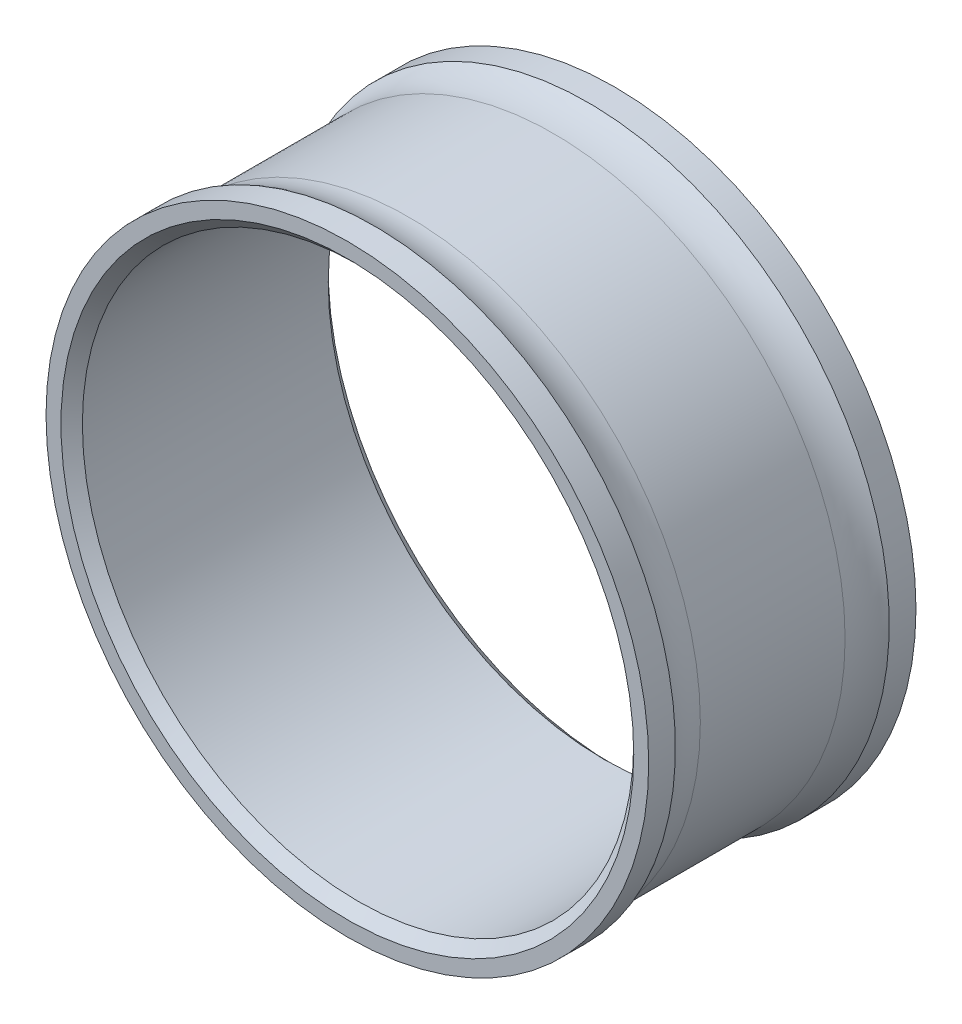
ISO-10303-21;
HEADER;
FILE_DESCRIPTION(('STEP AP214'),'2;1');
FILE_NAME('part.step','',(''),(''),'','','');
FILE_SCHEMA(('AUTOMOTIVE_DESIGN { 1 0 10303 214 1 1 1 1 }'));
ENDSEC;
DATA;
#1=APPLICATION_CONTEXT('core data for automotive mechanical design processes');
#2=APPLICATION_PROTOCOL_DEFINITION('international standard','automotive_design',2000,#1);
#3=PRODUCT_CONTEXT('',#1,'mechanical');
#4=PRODUCT('Part','Part','',(#3));
#5=PRODUCT_RELATED_PRODUCT_CATEGORY('part','',(#4));
#6=PRODUCT_DEFINITION_FORMATION('','',#4);
#7=PRODUCT_DEFINITION_CONTEXT('part definition',#1,'design');
#8=PRODUCT_DEFINITION('design','',#6,#7);
#9=PRODUCT_DEFINITION_SHAPE('','',#8);
#10=(LENGTH_UNIT() NAMED_UNIT(*) SI_UNIT(.MILLI.,.METRE.));
#11=(NAMED_UNIT(*) PLANE_ANGLE_UNIT() SI_UNIT($,.RADIAN.));
#12=(NAMED_UNIT(*) SI_UNIT($,.STERADIAN.) SOLID_ANGLE_UNIT());
#13=UNCERTAINTY_MEASURE_WITH_UNIT(LENGTH_MEASURE(1.E-05),#10,'distance_accuracy_value','');
#14=(GEOMETRIC_REPRESENTATION_CONTEXT(3) GLOBAL_UNCERTAINTY_ASSIGNED_CONTEXT((#13)) GLOBAL_UNIT_ASSIGNED_CONTEXT((#10,
#11,#12)) REPRESENTATION_CONTEXT('',''));
#15=CARTESIAN_POINT('',(0.,0.,0.));
#16=DIRECTION('',(0.,0.,1.));
#17=DIRECTION('',(1.,0.,0.));
#18=AXIS2_PLACEMENT_3D('',#15,#16,#17);
#19=CARTESIAN_POINT('',(0.,0.,-15.875));
#20=DIRECTION('',(0.,0.,1.));
#21=DIRECTION('',(-1.,0.,0.));
#22=AXIS2_PLACEMENT_3D('',#19,#20,#21);
#23=CYLINDRICAL_SURFACE('',#22,35.8013);
#24=CARTESIAN_POINT('',(0.,0.,15.875));
#25=DIRECTION('',(0.,0.,1.));
#26=DIRECTION('',(1.,0.,0.));
#27=AXIS2_PLACEMENT_3D('',#24,#25,#26);
#28=CIRCLE('',#27,35.8013);
#29=CARTESIAN_POINT('',(35.8013,0.,15.875));
#30=VERTEX_POINT('',#29);
#31=EDGE_CURVE('E53',#30,#30,#28,.T.);
#32=ORIENTED_EDGE('',*,*,#31,.F.);
#33=EDGE_LOOP('',(#32));
#34=FACE_BOUND('',#33,.T.);
#35=CARTESIAN_POINT('',(0.,0.,12.7));
#36=DIRECTION('',(0.,0.,-1.));
#37=DIRECTION('',(-1.,0.,0.));
#38=AXIS2_PLACEMENT_3D('',#35,#36,#37);
#39=CIRCLE('',#38,35.8013);
#40=CARTESIAN_POINT('',(-35.8013,0.,12.7));
#41=VERTEX_POINT('',#40);
#42=EDGE_CURVE('E67',#41,#41,#39,.T.);
#43=ORIENTED_EDGE('',*,*,#42,.F.);
#44=EDGE_LOOP('',(#43));
#45=FACE_BOUND('',#44,.T.);
#46=ADVANCED_FACE('F32',(#34,#45),#23,.T.);
#47=CARTESIAN_POINT('',(0.,0.,-15.875));
#48=DIRECTION('',(0.,0.,1.));
#49=DIRECTION('',(1.,0.,0.));
#50=AXIS2_PLACEMENT_3D('',#47,#48,#49);
#51=CIRCLE('',#50,35.8013);
#52=CARTESIAN_POINT('',(35.8013,0.,-15.875));
#53=VERTEX_POINT('',#52);
#54=EDGE_CURVE('E52',#53,#53,#51,.T.);
#55=ORIENTED_EDGE('',*,*,#54,.T.);
#56=EDGE_LOOP('',(#55));
#57=FACE_BOUND('',#56,.T.);
#58=CARTESIAN_POINT('',(0.,0.,-12.7));
#59=DIRECTION('',(0.,0.,-1.));
#60=DIRECTION('',(-1.,0.,0.));
#61=AXIS2_PLACEMENT_3D('',#58,#59,#60);
#62=CIRCLE('',#61,35.8013);
#63=CARTESIAN_POINT('',(-35.8013,0.,-12.7));
#64=VERTEX_POINT('',#63);
#65=EDGE_CURVE('E64',#64,#64,#62,.T.);
#66=ORIENTED_EDGE('',*,*,#65,.T.);
#67=EDGE_LOOP('',(#66));
#68=FACE_BOUND('',#67,.T.);
#69=ADVANCED_FACE('F74',(#57,#68),#23,.T.);
#70=CARTESIAN_POINT('',(0.,0.,-15.875));
#71=DIRECTION('',(0.,0.,-1.));
#72=DIRECTION('',(1.,0.,0.));
#73=AXIS2_PLACEMENT_3D('',#70,#71,#72);
#74=PLANE('',#73);
#75=CARTESIAN_POINT('',(0.,0.,-15.875));
#76=DIRECTION('',(0.,0.,1.));
#77=DIRECTION('',(1.,0.,0.));
#78=AXIS2_PLACEMENT_3D('',#75,#76,#77);
#79=CIRCLE('',#78,34.024);
#80=CARTESIAN_POINT('',(34.024,0.,-15.875));
#81=VERTEX_POINT('',#80);
#82=EDGE_CURVE('E10',#81,#81,#79,.F.);
#83=ORIENTED_EDGE('',*,*,#82,.F.);
#84=EDGE_LOOP('',(#83));
#85=FACE_BOUND('',#84,.T.);
#86=ORIENTED_EDGE('',*,*,#54,.F.);
#87=EDGE_LOOP('',(#86));
#88=FACE_BOUND('',#87,.T.);
#89=ADVANCED_FACE('F80',(#85,#88),#74,.T.);
#90=CARTESIAN_POINT('',(0.,0.,15.875));
#91=DIRECTION('',(0.,0.,-1.));
#92=DIRECTION('',(1.,0.,0.));
#93=AXIS2_PLACEMENT_3D('',#90,#91,#92);
#94=PLANE('',#93);
#95=CARTESIAN_POINT('',(0.,0.,15.875));
#96=DIRECTION('',(0.,0.,1.));
#97=DIRECTION('',(1.,0.,0.));
#98=AXIS2_PLACEMENT_3D('',#95,#96,#97);
#99=CIRCLE('',#98,34.024);
#100=CARTESIAN_POINT('',(34.024,0.,15.875));
#101=VERTEX_POINT('',#100);
#102=EDGE_CURVE('E47',#101,#101,#99,.T.);
#103=ORIENTED_EDGE('',*,*,#102,.F.);
#104=EDGE_LOOP('',(#103));
#105=FACE_BOUND('',#104,.T.);
#106=ORIENTED_EDGE('',*,*,#31,.T.);
#107=EDGE_LOOP('',(#106));
#108=FACE_BOUND('',#107,.T.);
#109=ADVANCED_FACE('F84',(#105,#108),#94,.F.);
#110=CARTESIAN_POINT('',(0.,0.,-15.875));
#111=DIRECTION('',(0.,0.,1.));
#112=DIRECTION('',(-1.,0.,0.));
#113=AXIS2_PLACEMENT_3D('',#110,#111,#112);
#114=CYLINDRICAL_SURFACE('',#113,32.754);
#115=CARTESIAN_POINT('',(0.,0.,14.605));
#116=DIRECTION('',(0.,0.,1.));
#117=DIRECTION('',(1.,0.,0.));
#118=AXIS2_PLACEMENT_3D('',#115,#116,#117);
#119=CIRCLE('',#118,32.754);
#120=CARTESIAN_POINT('',(32.754,0.,14.605));
#121=VERTEX_POINT('',#120);
#122=EDGE_CURVE('E39',#121,#121,#119,.F.);
#123=ORIENTED_EDGE('',*,*,#122,.F.);
#124=EDGE_LOOP('',(#123));
#125=FACE_BOUND('',#124,.T.);
#126=CARTESIAN_POINT('',(0.,0.,-14.605));
#127=DIRECTION('',(0.,0.,1.));
#128=DIRECTION('',(1.,0.,0.));
#129=AXIS2_PLACEMENT_3D('',#126,#127,#128);
#130=CIRCLE('',#129,32.754);
#131=CARTESIAN_POINT('',(32.754,0.,-14.605));
#132=VERTEX_POINT('',#131);
#133=EDGE_CURVE('E43',#132,#132,#130,.T.);
#134=ORIENTED_EDGE('',*,*,#133,.F.);
#135=EDGE_LOOP('',(#134));
#136=FACE_BOUND('',#135,.T.);
#137=ADVANCED_FACE('F88',(#125,#136),#114,.F.);
#138=CARTESIAN_POINT('',(0.,0.,15.875));
#139=DIRECTION('',(0.,0.,1.));
#140=DIRECTION('',(-1.,0.,0.));
#141=AXIS2_PLACEMENT_3D('',#138,#139,#140);
#142=CONICAL_SURFACE('',#141,34.024,0.785398163397446);
#143=ORIENTED_EDGE('',*,*,#122,.T.);
#144=EDGE_LOOP('',(#143));
#145=FACE_BOUND('',#144,.T.);
#146=ORIENTED_EDGE('',*,*,#102,.T.);
#147=EDGE_LOOP('',(#146));
#148=FACE_BOUND('',#147,.T.);
#149=ADVANCED_FACE('F86',(#145,#148),#142,.F.);
#150=CARTESIAN_POINT('',(0.,0.,-14.605));
#151=DIRECTION('',(0.,0.,-1.));
#152=DIRECTION('',(1.,0.,0.));
#153=AXIS2_PLACEMENT_3D('',#150,#151,#152);
#154=CONICAL_SURFACE('',#153,32.754,0.785398163397451);
#155=ORIENTED_EDGE('',*,*,#82,.T.);
#156=EDGE_LOOP('',(#155));
#157=FACE_BOUND('',#156,.T.);
#158=ORIENTED_EDGE('',*,*,#133,.T.);
#159=EDGE_LOOP('',(#158));
#160=FACE_BOUND('',#159,.T.);
#161=ADVANCED_FACE('F34',(#157,#160),#154,.F.);
#162=CARTESIAN_POINT('',(0.,0.,8.59766368882315));
#163=DIRECTION('',(0.,0.,1.));
#164=DIRECTION('',(-1.,0.,0.));
#165=AXIS2_PLACEMENT_3D('',#162,#163,#164);
#166=TOROIDAL_SURFACE('',#165,42.5965,7.9375);
#167=CARTESIAN_POINT('',(0.,0.,8.59766368882315));
#168=DIRECTION('',(0.,0.,-1.));
#169=DIRECTION('',(-1.,0.,0.));
#170=AXIS2_PLACEMENT_3D('',#167,#168,#169);
#171=CIRCLE('',#170,34.659);
#172=CARTESIAN_POINT('',(-34.659,0.,8.59766368882315));
#173=VERTEX_POINT('',#172);
#174=EDGE_CURVE('E56',#173,#173,#171,.T.);
#175=ORIENTED_EDGE('',*,*,#174,.F.);
#176=EDGE_LOOP('',(#175));
#177=FACE_BOUND('',#176,.T.);
#178=ORIENTED_EDGE('',*,*,#42,.T.);
#179=EDGE_LOOP('',(#178));
#180=FACE_BOUND('',#179,.T.);
#181=ADVANCED_FACE('F71',(#177,#180),#166,.F.);
#182=CARTESIAN_POINT('',(0.,0.,15.875));
#183=DIRECTION('',(0.,0.,1.));
#184=DIRECTION('',(-1.,0.,0.));
#185=AXIS2_PLACEMENT_3D('',#182,#183,#184);
#186=CYLINDRICAL_SURFACE('',#185,34.659);
#187=CARTESIAN_POINT('',(0.,0.,-8.59766368882315));
#188=DIRECTION('',(0.,0.,-1.));
#189=DIRECTION('',(-1.,0.,0.));
#190=AXIS2_PLACEMENT_3D('',#187,#188,#189);
#191=CIRCLE('',#190,34.659);
#192=CARTESIAN_POINT('',(-34.659,0.,-8.59766368882315));
#193=VERTEX_POINT('',#192);
#194=EDGE_CURVE('E61',#193,#193,#191,.T.);
#195=ORIENTED_EDGE('',*,*,#194,.F.);
#196=EDGE_LOOP('',(#195));
#197=FACE_BOUND('',#196,.T.);
#198=ORIENTED_EDGE('',*,*,#174,.T.);
#199=EDGE_LOOP('',(#198));
#200=FACE_BOUND('',#199,.T.);
#201=ADVANCED_FACE('F110',(#197,#200),#186,.T.);
#202=CARTESIAN_POINT('',(0.,0.,-8.59766368882315));
#203=DIRECTION('',(0.,0.,1.));
#204=DIRECTION('',(-1.,0.,0.));
#205=AXIS2_PLACEMENT_3D('',#202,#203,#204);
#206=TOROIDAL_SURFACE('',#205,42.5965,7.9375);
#207=ORIENTED_EDGE('',*,*,#65,.F.);
#208=EDGE_LOOP('',(#207));
#209=FACE_BOUND('',#208,.T.);
#210=ORIENTED_EDGE('',*,*,#194,.T.);
#211=EDGE_LOOP('',(#210));
#212=FACE_BOUND('',#211,.T.);
#213=ADVANCED_FACE('F114',(#209,#212),#206,.F.);
#214=CLOSED_SHELL('',(#46,#69,#89,#109,#137,#149,#161,#181,#201,#213));
#215=MANIFOLD_SOLID_BREP('B2',#214);
#216=ADVANCED_BREP_SHAPE_REPRESENTATION('',(#18,#215),#14);
#217=SHAPE_DEFINITION_REPRESENTATION(#9,#216);
ENDSEC;
END-ISO-10303-21;
